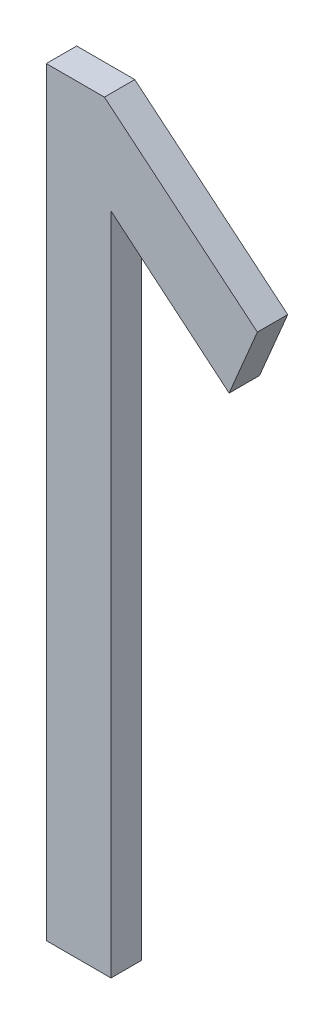
ISO-10303-21;
HEADER;
FILE_DESCRIPTION(('STEP AP214'),'2;1');
FILE_NAME('part.step','',(''),(''),'','','');
FILE_SCHEMA(('AUTOMOTIVE_DESIGN { 1 0 10303 214 1 1 1 1 }'));
ENDSEC;
DATA;
#1=APPLICATION_CONTEXT('core data for automotive mechanical design processes');
#2=APPLICATION_PROTOCOL_DEFINITION('international standard','automotive_design',2000,#1);
#3=PRODUCT_CONTEXT('',#1,'mechanical');
#4=PRODUCT('Part','Part','',(#3));
#5=PRODUCT_RELATED_PRODUCT_CATEGORY('part','',(#4));
#6=PRODUCT_DEFINITION_FORMATION('','',#4);
#7=PRODUCT_DEFINITION_CONTEXT('part definition',#1,'design');
#8=PRODUCT_DEFINITION('design','',#6,#7);
#9=PRODUCT_DEFINITION_SHAPE('','',#8);
#10=(LENGTH_UNIT() NAMED_UNIT(*) SI_UNIT(.MILLI.,.METRE.));
#11=(NAMED_UNIT(*) PLANE_ANGLE_UNIT() SI_UNIT($,.RADIAN.));
#12=(NAMED_UNIT(*) SI_UNIT($,.STERADIAN.) SOLID_ANGLE_UNIT());
#13=UNCERTAINTY_MEASURE_WITH_UNIT(LENGTH_MEASURE(1.E-05),#10,'distance_accuracy_value','');
#14=(GEOMETRIC_REPRESENTATION_CONTEXT(3) GLOBAL_UNCERTAINTY_ASSIGNED_CONTEXT((#13)) GLOBAL_UNIT_ASSIGNED_CONTEXT((#10,
#11,#12)) REPRESENTATION_CONTEXT('',''));
#15=CARTESIAN_POINT('',(0.,0.,0.));
#16=DIRECTION('',(0.,0.,1.));
#17=DIRECTION('',(1.,0.,0.));
#18=AXIS2_PLACEMENT_3D('',#15,#16,#17);
#19=CARTESIAN_POINT('',(177.688267589398,124.913993413852,-39.));
#20=DIRECTION('',(0.,0.,-1.));
#21=DIRECTION('',(-1.,0.,0.));
#22=AXIS2_PLACEMENT_3D('',#19,#20,#21);
#23=PLANE('',#22);
#24=DIRECTION('',(0.,1.,0.));
#25=VECTOR('',#24,1.);
#26=CARTESIAN_POINT('',(177.794792895469,124.913993413852,-39.));
#27=LINE('',#26,#25);
#28=CARTESIAN_POINT('',(177.794792895469,127.100335393736,-39.));
#29=VERTEX_POINT('',#28);
#30=CARTESIAN_POINT('',(177.794792895469,124.913993413852,-39.));
#31=VERTEX_POINT('',#30);
#32=EDGE_CURVE('E115',#29,#31,#27,.F.);
#33=ORIENTED_EDGE('',*,*,#32,.F.);
#34=DIRECTION('',(0.767292476513011,-0.64129732221999,0.));
#35=VECTOR('',#34,1.);
#36=CARTESIAN_POINT('',(177.794792895469,127.100335393736,-39.));
#37=LINE('',#36,#35);
#38=CARTESIAN_POINT('',(178.183534533737,126.775428035345,-39.));
#39=VERTEX_POINT('',#38);
#40=EDGE_CURVE('E110',#39,#29,#37,.F.);
#41=ORIENTED_EDGE('',*,*,#40,.F.);
#42=DIRECTION('',(0.388459001127913,0.921466008294774,0.));
#43=VECTOR('',#42,1.);
#44=CARTESIAN_POINT('',(178.183534533737,126.775428035345,-39.));
#45=LINE('',#44,#43);
#46=CARTESIAN_POINT('',(178.276428639505,126.995782720364,-39.));
#47=VERTEX_POINT('',#46);
#48=EDGE_CURVE('E104',#47,#39,#45,.F.);
#49=ORIENTED_EDGE('',*,*,#48,.F.);
#50=DIRECTION('',(-0.769154762061797,0.639062557186431,0.));
#51=VECTOR('',#50,1.);
#52=CARTESIAN_POINT('',(178.276428639505,126.995782720364,-39.));
#53=LINE('',#52,#51);
#54=CARTESIAN_POINT('',(177.773083946838,127.413993413853,-39.));
#55=VERTEX_POINT('',#54);
#56=EDGE_CURVE('E98',#55,#47,#53,.F.);
#57=ORIENTED_EDGE('',*,*,#56,.F.);
#58=DIRECTION('',(1.,0.,0.));
#59=VECTOR('',#58,1.);
#60=CARTESIAN_POINT('',(177.773083946838,127.413993413853,-39.));
#61=LINE('',#60,#59);
#62=CARTESIAN_POINT('',(177.581742283327,127.413993413853,-39.));
#63=VERTEX_POINT('',#62);
#64=EDGE_CURVE('E74',#63,#55,#61,.T.);
#65=ORIENTED_EDGE('',*,*,#64,.F.);
#66=DIRECTION('',(0.,1.,0.));
#67=VECTOR('',#66,1.);
#68=CARTESIAN_POINT('',(177.581742283327,127.413993413853,-39.));
#69=LINE('',#68,#67);
#70=CARTESIAN_POINT('',(177.581742283327,124.913993413852,-39.));
#71=VERTEX_POINT('',#70);
#72=EDGE_CURVE('E76',#71,#63,#69,.T.);
#73=ORIENTED_EDGE('',*,*,#72,.F.);
#74=DIRECTION('',(1.,0.,0.));
#75=VECTOR('',#74,1.);
#76=CARTESIAN_POINT('',(177.581742283327,124.913993413852,-39.));
#77=LINE('',#76,#75);
#78=EDGE_CURVE('E20',#31,#71,#77,.F.);
#79=ORIENTED_EDGE('',*,*,#78,.F.);
#80=EDGE_LOOP('',(#33,#41,#49,#57,#65,#73,#79));
#81=FACE_BOUND('',#80,.T.);
#82=ADVANCED_FACE('F17',(#81),#23,.F.);
#83=CARTESIAN_POINT('',(177.581742283327,124.913993413852,-39.1));
#84=DIRECTION('',(0.,-1.,0.));
#85=DIRECTION('',(0.,0.,-1.));
#86=AXIS2_PLACEMENT_3D('',#83,#84,#85);
#87=PLANE('',#86);
#88=DIRECTION('',(-1.,0.,0.));
#89=VECTOR('',#88,1.);
#90=CARTESIAN_POINT('',(177.688267589398,124.913993413852,-39.1));
#91=LINE('',#90,#89);
#92=CARTESIAN_POINT('',(177.794792895469,124.913993413852,-39.1));
#93=VERTEX_POINT('',#92);
#94=CARTESIAN_POINT('',(177.581742283327,124.913993413852,-39.1));
#95=VERTEX_POINT('',#94);
#96=EDGE_CURVE('E119',#93,#95,#91,.T.);
#97=ORIENTED_EDGE('',*,*,#96,.F.);
#98=DIRECTION('',(0.,0.,-1.));
#99=VECTOR('',#98,1.);
#100=CARTESIAN_POINT('',(177.794792895469,124.913993413852,-39.1));
#101=LINE('',#100,#99);
#102=EDGE_CURVE('E87',#31,#93,#101,.T.);
#103=ORIENTED_EDGE('',*,*,#102,.F.);
#104=ORIENTED_EDGE('',*,*,#78,.T.);
#105=DIRECTION('',(0.,0.,1.));
#106=VECTOR('',#105,1.);
#107=CARTESIAN_POINT('',(177.581742283327,124.913993413852,-39.1));
#108=LINE('',#107,#106);
#109=EDGE_CURVE('E82',#95,#71,#108,.T.);
#110=ORIENTED_EDGE('',*,*,#109,.F.);
#111=EDGE_LOOP('',(#97,#103,#104,#110));
#112=FACE_BOUND('',#111,.T.);
#113=ADVANCED_FACE('F84',(#112),#87,.T.);
#114=CARTESIAN_POINT('',(177.581742283327,127.413993413853,-39.1));
#115=DIRECTION('',(-1.,0.,0.));
#116=DIRECTION('',(0.,0.,1.));
#117=AXIS2_PLACEMENT_3D('',#114,#115,#116);
#118=PLANE('',#117);
#119=DIRECTION('',(0.,1.,0.));
#120=VECTOR('',#119,1.);
#121=CARTESIAN_POINT('',(177.581742283327,124.913993413852,-39.1));
#122=LINE('',#121,#120);
#123=CARTESIAN_POINT('',(177.581742283327,127.413993413853,-39.1));
#124=VERTEX_POINT('',#123);
#125=EDGE_CURVE('E91',#95,#124,#122,.T.);
#126=ORIENTED_EDGE('',*,*,#125,.F.);
#127=ORIENTED_EDGE('',*,*,#109,.T.);
#128=ORIENTED_EDGE('',*,*,#72,.T.);
#129=DIRECTION('',(0.,0.,1.));
#130=VECTOR('',#129,1.);
#131=CARTESIAN_POINT('',(177.581742283327,127.413993413853,-39.1));
#132=LINE('',#131,#130);
#133=EDGE_CURVE('E94',#124,#63,#132,.T.);
#134=ORIENTED_EDGE('',*,*,#133,.F.);
#135=EDGE_LOOP('',(#126,#127,#128,#134));
#136=FACE_BOUND('',#135,.T.);
#137=ADVANCED_FACE('F89',(#136),#118,.T.);
#138=CARTESIAN_POINT('',(177.773083946838,127.413993413853,-39.1));
#139=DIRECTION('',(0.,1.,0.));
#140=DIRECTION('',(0.,0.,1.));
#141=AXIS2_PLACEMENT_3D('',#138,#139,#140);
#142=PLANE('',#141);
#143=DIRECTION('',(-1.,0.,0.));
#144=VECTOR('',#143,1.);
#145=CARTESIAN_POINT('',(177.688267589398,127.413993413853,-39.1));
#146=LINE('',#145,#144);
#147=CARTESIAN_POINT('',(177.773083946838,127.413993413853,-39.1));
#148=VERTEX_POINT('',#147);
#149=EDGE_CURVE('E122',#124,#148,#146,.F.);
#150=ORIENTED_EDGE('',*,*,#149,.F.);
#151=ORIENTED_EDGE('',*,*,#133,.T.);
#152=ORIENTED_EDGE('',*,*,#64,.T.);
#153=DIRECTION('',(0.,0.,1.));
#154=VECTOR('',#153,1.);
#155=CARTESIAN_POINT('',(177.773083946838,127.413993413853,-39.1));
#156=LINE('',#155,#154);
#157=EDGE_CURVE('E101',#148,#55,#156,.T.);
#158=ORIENTED_EDGE('',*,*,#157,.F.);
#159=EDGE_LOOP('',(#150,#151,#152,#158));
#160=FACE_BOUND('',#159,.T.);
#161=ADVANCED_FACE('F143',(#160),#142,.T.);
#162=CARTESIAN_POINT('',(178.276428639505,126.995782720364,-39.1));
#163=DIRECTION('',(0.639062557186431,0.769154762061797,0.));
#164=DIRECTION('',(-0.769154762061797,0.639062557186431,0.));
#165=AXIS2_PLACEMENT_3D('',#162,#163,#164);
#166=PLANE('',#165);
#167=DIRECTION('',(0.769154762061825,-0.639062557186398,0.));
#168=VECTOR('',#167,1.);
#169=CARTESIAN_POINT('',(177.773083946838,127.413993413853,-39.1));
#170=LINE('',#169,#168);
#171=CARTESIAN_POINT('',(178.276428639505,126.995782720364,-39.1));
#172=VERTEX_POINT('',#171);
#173=EDGE_CURVE('E125',#148,#172,#170,.T.);
#174=ORIENTED_EDGE('',*,*,#173,.F.);
#175=ORIENTED_EDGE('',*,*,#157,.T.);
#176=ORIENTED_EDGE('',*,*,#56,.T.);
#177=DIRECTION('',(0.,0.,1.));
#178=VECTOR('',#177,1.);
#179=CARTESIAN_POINT('',(178.276428639505,126.995782720364,-39.1));
#180=LINE('',#179,#178);
#181=EDGE_CURVE('E107',#172,#47,#180,.T.);
#182=ORIENTED_EDGE('',*,*,#181,.F.);
#183=EDGE_LOOP('',(#174,#175,#176,#182));
#184=FACE_BOUND('',#183,.T.);
#185=ADVANCED_FACE('F140',(#184),#166,.T.);
#186=CARTESIAN_POINT('',(178.183534533737,126.775428035345,-39.1));
#187=DIRECTION('',(0.921466008294774,-0.388459001127913,0.));
#188=DIRECTION('',(0.388459001127913,0.921466008294774,0.));
#189=AXIS2_PLACEMENT_3D('',#186,#187,#188);
#190=PLANE('',#189);
#191=DIRECTION('',(-0.388459001127848,-0.921466008294801,0.));
#192=VECTOR('',#191,1.);
#193=CARTESIAN_POINT('',(178.276428639505,126.995782720364,-39.1));
#194=LINE('',#193,#192);
#195=CARTESIAN_POINT('',(178.183534533737,126.775428035345,-39.1));
#196=VERTEX_POINT('',#195);
#197=EDGE_CURVE('E128',#172,#196,#194,.T.);
#198=ORIENTED_EDGE('',*,*,#197,.F.);
#199=ORIENTED_EDGE('',*,*,#181,.T.);
#200=ORIENTED_EDGE('',*,*,#48,.T.);
#201=DIRECTION('',(0.,0.,1.));
#202=VECTOR('',#201,1.);
#203=CARTESIAN_POINT('',(178.183534533737,126.775428035345,-39.1));
#204=LINE('',#203,#202);
#205=EDGE_CURVE('E112',#196,#39,#204,.T.);
#206=ORIENTED_EDGE('',*,*,#205,.F.);
#207=EDGE_LOOP('',(#198,#199,#200,#206));
#208=FACE_BOUND('',#207,.T.);
#209=ADVANCED_FACE('F137',(#208),#190,.T.);
#210=CARTESIAN_POINT('',(177.794792895469,127.100335393736,-39.1));
#211=DIRECTION('',(-0.64129732221999,-0.767292476513011,0.));
#212=DIRECTION('',(0.767292476513011,-0.64129732221999,0.));
#213=AXIS2_PLACEMENT_3D('',#210,#211,#212);
#214=PLANE('',#213);
#215=DIRECTION('',(-0.767292476512982,0.641297322220025,0.));
#216=VECTOR('',#215,1.);
#217=CARTESIAN_POINT('',(178.183534533737,126.775428035345,-39.1));
#218=LINE('',#217,#216);
#219=CARTESIAN_POINT('',(177.794792895469,127.100335393736,-39.1));
#220=VERTEX_POINT('',#219);
#221=EDGE_CURVE('E26',#196,#220,#218,.T.);
#222=ORIENTED_EDGE('',*,*,#221,.F.);
#223=ORIENTED_EDGE('',*,*,#205,.T.);
#224=ORIENTED_EDGE('',*,*,#40,.T.);
#225=DIRECTION('',(0.,0.,-1.));
#226=VECTOR('',#225,1.);
#227=CARTESIAN_POINT('',(177.794792895469,127.100335393736,-39.1));
#228=LINE('',#227,#226);
#229=EDGE_CURVE('E35',#220,#29,#228,.F.);
#230=ORIENTED_EDGE('',*,*,#229,.F.);
#231=EDGE_LOOP('',(#222,#223,#224,#230));
#232=FACE_BOUND('',#231,.T.);
#233=ADVANCED_FACE('F135',(#232),#214,.T.);
#234=CARTESIAN_POINT('',(177.794792895469,124.913993413852,-39.1));
#235=DIRECTION('',(1.,0.,0.));
#236=DIRECTION('',(0.,0.,-1.));
#237=AXIS2_PLACEMENT_3D('',#234,#235,#236);
#238=PLANE('',#237);
#239=DIRECTION('',(0.,1.,0.));
#240=VECTOR('',#239,1.);
#241=CARTESIAN_POINT('',(177.794792895469,124.913993413852,-39.1));
#242=LINE('',#241,#240);
#243=EDGE_CURVE('E11',#220,#93,#242,.F.);
#244=ORIENTED_EDGE('',*,*,#243,.F.);
#245=ORIENTED_EDGE('',*,*,#229,.T.);
#246=ORIENTED_EDGE('',*,*,#32,.T.);
#247=ORIENTED_EDGE('',*,*,#102,.T.);
#248=EDGE_LOOP('',(#244,#245,#246,#247));
#249=FACE_BOUND('',#248,.T.);
#250=ADVANCED_FACE('F145',(#249),#238,.T.);
#251=CARTESIAN_POINT('',(177.688267589398,124.913993413852,-39.1));
#252=DIRECTION('',(0.,0.,-1.));
#253=DIRECTION('',(-1.,0.,0.));
#254=AXIS2_PLACEMENT_3D('',#251,#252,#253);
#255=PLANE('',#254);
#256=ORIENTED_EDGE('',*,*,#221,.T.);
#257=ORIENTED_EDGE('',*,*,#243,.T.);
#258=ORIENTED_EDGE('',*,*,#96,.T.);
#259=ORIENTED_EDGE('',*,*,#125,.T.);
#260=ORIENTED_EDGE('',*,*,#149,.T.);
#261=ORIENTED_EDGE('',*,*,#173,.T.);
#262=ORIENTED_EDGE('',*,*,#197,.T.);
#263=EDGE_LOOP('',(#256,#257,#258,#259,#260,#261,#262));
#264=FACE_BOUND('',#263,.T.);
#265=ADVANCED_FACE('F133',(#264),#255,.T.);
#266=CLOSED_SHELL('',(#82,#113,#137,#161,#185,#209,#233,#250,#265));
#267=MANIFOLD_SOLID_BREP('B1',#266);
#268=ADVANCED_BREP_SHAPE_REPRESENTATION('',(#18,#267),#14);
#269=SHAPE_DEFINITION_REPRESENTATION(#9,#268);
ENDSEC;
END-ISO-10303-21;
